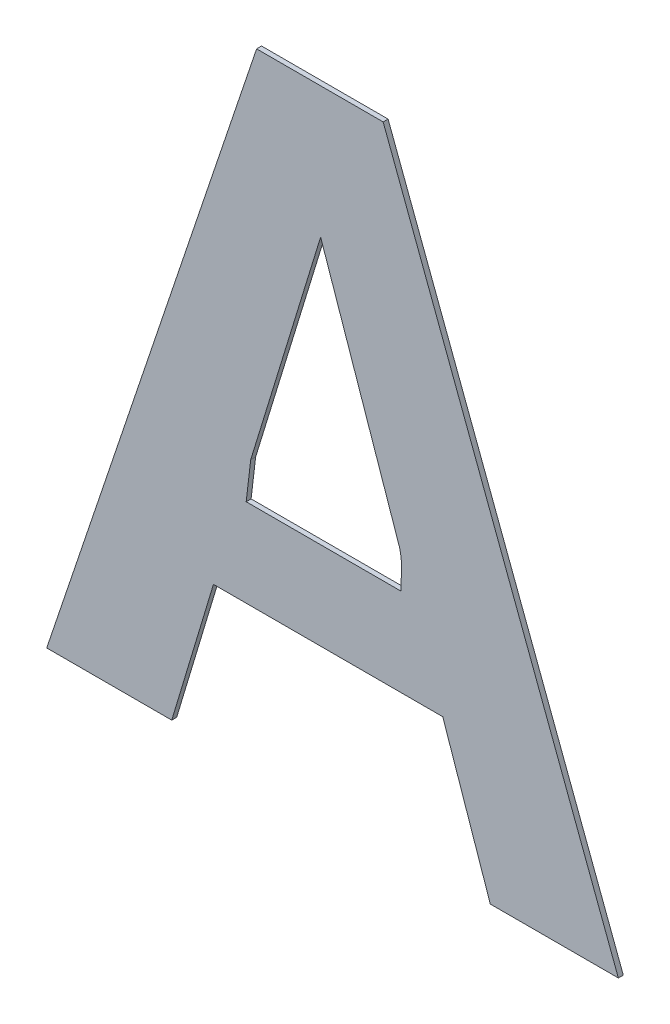
ISO-10303-21;
HEADER;
FILE_DESCRIPTION(('STEP AP214'),'2;1');
FILE_NAME('part.step','',(''),(''),'','','');
FILE_SCHEMA(('AUTOMOTIVE_DESIGN { 1 0 10303 214 1 1 1 1 }'));
ENDSEC;
DATA;
#1=APPLICATION_CONTEXT('core data for automotive mechanical design processes');
#2=APPLICATION_PROTOCOL_DEFINITION('international standard','automotive_design',2000,#1);
#3=PRODUCT_CONTEXT('',#1,'mechanical');
#4=PRODUCT('Part','Part','',(#3));
#5=PRODUCT_RELATED_PRODUCT_CATEGORY('part','',(#4));
#6=PRODUCT_DEFINITION_FORMATION('','',#4);
#7=PRODUCT_DEFINITION_CONTEXT('part definition',#1,'design');
#8=PRODUCT_DEFINITION('design','',#6,#7);
#9=PRODUCT_DEFINITION_SHAPE('','',#8);
#10=(LENGTH_UNIT() NAMED_UNIT(*) SI_UNIT(.MILLI.,.METRE.));
#11=(NAMED_UNIT(*) PLANE_ANGLE_UNIT() SI_UNIT($,.RADIAN.));
#12=(NAMED_UNIT(*) SI_UNIT($,.STERADIAN.) SOLID_ANGLE_UNIT());
#13=UNCERTAINTY_MEASURE_WITH_UNIT(LENGTH_MEASURE(1.E-05),#10,'distance_accuracy_value','');
#14=(GEOMETRIC_REPRESENTATION_CONTEXT(3) GLOBAL_UNCERTAINTY_ASSIGNED_CONTEXT((#13)) GLOBAL_UNIT_ASSIGNED_CONTEXT((#10,
#11,#12)) REPRESENTATION_CONTEXT('',''));
#15=CARTESIAN_POINT('',(0.,0.,0.));
#16=DIRECTION('',(0.,0.,1.));
#17=DIRECTION('',(1.,0.,0.));
#18=AXIS2_PLACEMENT_3D('',#15,#16,#17);
#19=CARTESIAN_POINT('',(-0.7350314078679,0.048062897260646,0.00086146168299));
#20=DIRECTION('',(-0.945790685009935,-0.324776815903535,0.));
#21=DIRECTION('',(0.,0.,1.));
#22=AXIS2_PLACEMENT_3D('',#19,#20,#21);
#23=PLANE('',#22);
#24=DIRECTION('',(0.,0.,1.));
#25=VECTOR('',#24,1.);
#26=CARTESIAN_POINT('',(-0.7292514969013,0.031231074037092,-0.00033853831701));
#27=LINE('',#26,#25);
#28=CARTESIAN_POINT('',(-0.7292514969013,0.031231074037092,-0.00033853831701));
#29=VERTEX_POINT('',#28);
#30=CARTESIAN_POINT('',(-0.7292514969013,0.031231074037092,0.00086146168299));
#31=VERTEX_POINT('',#30);
#32=EDGE_CURVE('E11',#29,#31,#27,.T.);
#33=ORIENTED_EDGE('',*,*,#32,.T.);
#34=DIRECTION('',(-0.324776815903535,0.945790685009935,0.));
#35=VECTOR('',#34,1.);
#36=CARTESIAN_POINT('',(-0.7292514969013,0.031231074037092,0.00086146168299));
#37=LINE('',#36,#35);
#38=CARTESIAN_POINT('',(-0.7408113188345,0.0648947204842,0.00086146168299));
#39=VERTEX_POINT('',#38);
#40=EDGE_CURVE('E24',#31,#39,#37,.T.);
#41=ORIENTED_EDGE('',*,*,#40,.T.);
#42=DIRECTION('',(0.,0.,1.));
#43=VECTOR('',#42,1.);
#44=CARTESIAN_POINT('',(-0.7408113188345,0.0648947204842,-0.00033853831701));
#45=LINE('',#44,#43);
#46=CARTESIAN_POINT('',(-0.7408113188345,0.0648947204842,-0.00033853831701));
#47=VERTEX_POINT('',#46);
#48=EDGE_CURVE('E224',#47,#39,#45,.T.);
#49=ORIENTED_EDGE('',*,*,#48,.F.);
#50=DIRECTION('',(-0.324776815903535,0.945790685009935,0.));
#51=VECTOR('',#50,1.);
#52=CARTESIAN_POINT('',(-0.7292514969013,0.031231074037092,-0.00033853831701));
#53=LINE('',#52,#51);
#54=EDGE_CURVE('E221',#29,#47,#53,.T.);
#55=ORIENTED_EDGE('',*,*,#54,.F.);
#56=EDGE_LOOP('',(#33,#41,#49,#55));
#57=FACE_BOUND('',#56,.T.);
#58=ADVANCED_FACE('F17',(#57),#23,.T.);
#59=CARTESIAN_POINT('',(-0.7686863844487,0.0648947204842,0.00086146168299));
#60=DIRECTION('',(0.,-1.,0.));
#61=DIRECTION('',(0.,0.,-1.));
#62=AXIS2_PLACEMENT_3D('',#59,#60,#61);
#63=PLANE('',#62);
#64=ORIENTED_EDGE('',*,*,#48,.T.);
#65=DIRECTION('',(-1.,0.,0.));
#66=VECTOR('',#65,1.);
#67=CARTESIAN_POINT('',(-0.7408113188345,0.0648947204842,0.00086146168299));
#68=LINE('',#67,#66);
#69=CARTESIAN_POINT('',(-0.7965614500629,0.0648947204842,0.00086146168299));
#70=VERTEX_POINT('',#69);
#71=EDGE_CURVE('E219',#39,#70,#68,.T.);
#72=ORIENTED_EDGE('',*,*,#71,.T.);
#73=DIRECTION('',(0.,0.,1.));
#74=VECTOR('',#73,1.);
#75=CARTESIAN_POINT('',(-0.7965614500629,0.0648947204842,-0.00033853831701));
#76=LINE('',#75,#74);
#77=CARTESIAN_POINT('',(-0.7965614500629,0.0648947204842,-0.00033853831701));
#78=VERTEX_POINT('',#77);
#79=EDGE_CURVE('E216',#78,#70,#76,.T.);
#80=ORIENTED_EDGE('',*,*,#79,.F.);
#81=DIRECTION('',(-1.,0.,0.));
#82=VECTOR('',#81,1.);
#83=CARTESIAN_POINT('',(-0.7408113188345,0.0648947204842,-0.00033853831701));
#84=LINE('',#83,#82);
#85=EDGE_CURVE('E213',#47,#78,#84,.T.);
#86=ORIENTED_EDGE('',*,*,#85,.F.);
#87=EDGE_LOOP('',(#64,#72,#80,#86));
#88=FACE_BOUND('',#87,.T.);
#89=ADVANCED_FACE('F231',(#88),#63,.T.);
#90=CARTESIAN_POINT('',(-0.8016318769583,0.048062897260646,0.00086146168299));
#91=DIRECTION('',(0.957498753383215,-0.288437406155287,0.));
#92=DIRECTION('',(0.,0.,-1.));
#93=AXIS2_PLACEMENT_3D('',#90,#91,#92);
#94=PLANE('',#93);
#95=ORIENTED_EDGE('',*,*,#79,.T.);
#96=DIRECTION('',(-0.288437406155287,-0.957498753383215,0.));
#97=VECTOR('',#96,1.);
#98=CARTESIAN_POINT('',(-0.7965614500629,0.0648947204842,0.00086146168299));
#99=LINE('',#98,#97);
#100=CARTESIAN_POINT('',(-0.8067023038537,0.031231074037092,0.00086146168299));
#101=VERTEX_POINT('',#100);
#102=EDGE_CURVE('E211',#70,#101,#99,.T.);
#103=ORIENTED_EDGE('',*,*,#102,.T.);
#104=DIRECTION('',(0.,0.,1.));
#105=VECTOR('',#104,1.);
#106=CARTESIAN_POINT('',(-0.8067023038537,0.031231074037092,-0.00033853831701));
#107=LINE('',#106,#105);
#108=CARTESIAN_POINT('',(-0.8067023038537,0.031231074037092,-0.00033853831701));
#109=VERTEX_POINT('',#108);
#110=EDGE_CURVE('E208',#109,#101,#107,.T.);
#111=ORIENTED_EDGE('',*,*,#110,.F.);
#112=DIRECTION('',(-0.288437406155287,-0.957498753383215,0.));
#113=VECTOR('',#112,1.);
#114=CARTESIAN_POINT('',(-0.7965614500629,0.0648947204842,-0.00033853831701));
#115=LINE('',#114,#113);
#116=EDGE_CURVE('E205',#78,#109,#115,.T.);
#117=ORIENTED_EDGE('',*,*,#116,.F.);
#118=EDGE_LOOP('',(#95,#103,#111,#117));
#119=FACE_BOUND('',#118,.T.);
#120=ADVANCED_FACE('F238',(#119),#94,.T.);
#121=CARTESIAN_POINT('',(-0.8218998572515,0.031231074037092,0.00086146168299));
#122=DIRECTION('',(0.,-1.,0.));
#123=DIRECTION('',(0.,0.,-1.));
#124=AXIS2_PLACEMENT_3D('',#121,#122,#123);
#125=PLANE('',#124);
#126=ORIENTED_EDGE('',*,*,#110,.T.);
#127=DIRECTION('',(-1.,0.,0.));
#128=VECTOR('',#127,1.);
#129=CARTESIAN_POINT('',(-0.8067023038537,0.031231074037092,0.00086146168299));
#130=LINE('',#129,#128);
#131=CARTESIAN_POINT('',(-0.8370974106493,0.031231074037092,0.00086146168299));
#132=VERTEX_POINT('',#131);
#133=EDGE_CURVE('E203',#101,#132,#130,.T.);
#134=ORIENTED_EDGE('',*,*,#133,.T.);
#135=DIRECTION('',(0.,0.,1.));
#136=VECTOR('',#135,1.);
#137=CARTESIAN_POINT('',(-0.8370974106493,0.031231074037092,-0.00033853831701));
#138=LINE('',#137,#136);
#139=CARTESIAN_POINT('',(-0.8370974106493,0.031231074037092,-0.00033853831701));
#140=VERTEX_POINT('',#139);
#141=EDGE_CURVE('E200',#140,#132,#138,.T.);
#142=ORIENTED_EDGE('',*,*,#141,.F.);
#143=DIRECTION('',(-1.,0.,0.));
#144=VECTOR('',#143,1.);
#145=CARTESIAN_POINT('',(-0.8067023038537,0.031231074037092,-0.00033853831701));
#146=LINE('',#145,#144);
#147=EDGE_CURVE('E197',#109,#140,#146,.T.);
#148=ORIENTED_EDGE('',*,*,#147,.F.);
#149=EDGE_LOOP('',(#126,#134,#142,#148));
#150=FACE_BOUND('',#149,.T.);
#151=ADVANCED_FACE('F242',(#150),#125,.T.);
#152=CARTESIAN_POINT('',(-0.8115830774205,0.107055919785846,0.00086146168299));
#153=DIRECTION('',(-0.947781810602994,0.318919487473109,0.));
#154=DIRECTION('',(0.,0.,1.));
#155=AXIS2_PLACEMENT_3D('',#152,#153,#154);
#156=PLANE('',#155);
#157=ORIENTED_EDGE('',*,*,#141,.T.);
#158=DIRECTION('',(0.318919487473109,0.947781810602994,0.));
#159=VECTOR('',#158,1.);
#160=CARTESIAN_POINT('',(-0.8370974106493,0.031231074037092,0.00086146168299));
#161=LINE('',#160,#159);
#162=CARTESIAN_POINT('',(-0.7860687441917,0.1828807655346,0.00086146168299));
#163=VERTEX_POINT('',#162);
#164=EDGE_CURVE('E195',#132,#163,#161,.T.);
#165=ORIENTED_EDGE('',*,*,#164,.T.);
#166=DIRECTION('',(0.,0.,1.));
#167=VECTOR('',#166,1.);
#168=CARTESIAN_POINT('',(-0.7860687441917,0.1828807655346,-0.00033853831701));
#169=LINE('',#168,#167);
#170=CARTESIAN_POINT('',(-0.7860687441917,0.1828807655346,-0.00033853831701));
#171=VERTEX_POINT('',#170);
#172=EDGE_CURVE('E192',#171,#163,#169,.T.);
#173=ORIENTED_EDGE('',*,*,#172,.F.);
#174=DIRECTION('',(0.318919487473109,0.947781810602994,0.));
#175=VECTOR('',#174,1.);
#176=CARTESIAN_POINT('',(-0.8370974106493,0.031231074037092,-0.00033853831701));
#177=LINE('',#176,#175);
#178=EDGE_CURVE('E189',#140,#171,#177,.T.);
#179=ORIENTED_EDGE('',*,*,#178,.F.);
#180=EDGE_LOOP('',(#157,#165,#173,#179));
#181=FACE_BOUND('',#180,.T.);
#182=ADVANCED_FACE('F247',(#181),#156,.T.);
#183=CARTESIAN_POINT('',(-0.7706876786207,0.1828807655346,0.00086146168299));
#184=DIRECTION('',(0.,1.,0.));
#185=DIRECTION('',(0.,0.,1.));
#186=AXIS2_PLACEMENT_3D('',#183,#184,#185);
#187=PLANE('',#186);
#188=ORIENTED_EDGE('',*,*,#172,.T.);
#189=DIRECTION('',(1.,0.,0.));
#190=VECTOR('',#189,1.);
#191=CARTESIAN_POINT('',(-0.7860687441917,0.1828807655346,0.00086146168299));
#192=LINE('',#191,#190);
#193=CARTESIAN_POINT('',(-0.7553066130497,0.1828807655346,0.00086146168299));
#194=VERTEX_POINT('',#193);
#195=EDGE_CURVE('E187',#163,#194,#192,.T.);
#196=ORIENTED_EDGE('',*,*,#195,.T.);
#197=DIRECTION('',(0.,0.,1.));
#198=VECTOR('',#197,1.);
#199=CARTESIAN_POINT('',(-0.7553066130497,0.1828807655346,-0.00033853831701));
#200=LINE('',#199,#198);
#201=CARTESIAN_POINT('',(-0.7553066130497,0.1828807655346,-0.00033853831701));
#202=VERTEX_POINT('',#201);
#203=EDGE_CURVE('E184',#202,#194,#200,.T.);
#204=ORIENTED_EDGE('',*,*,#203,.F.);
#205=DIRECTION('',(1.,0.,0.));
#206=VECTOR('',#205,1.);
#207=CARTESIAN_POINT('',(-0.7860687441917,0.1828807655346,-0.00033853831701));
#208=LINE('',#207,#206);
#209=EDGE_CURVE('E181',#171,#202,#208,.T.);
#210=ORIENTED_EDGE('',*,*,#209,.F.);
#211=EDGE_LOOP('',(#188,#196,#204,#210));
#212=FACE_BOUND('',#211,.T.);
#213=ADVANCED_FACE('F250',(#212),#187,.T.);
#214=CARTESIAN_POINT('',(-0.7267144772313,0.107055919785846,0.00086146168299));
#215=DIRECTION('',(0.935687346706647,0.352830255523921,0.));
#216=DIRECTION('',(0.,0.,-1.));
#217=AXIS2_PLACEMENT_3D('',#214,#215,#216);
#218=PLANE('',#217);
#219=ORIENTED_EDGE('',*,*,#203,.T.);
#220=DIRECTION('',(0.352830255523921,-0.935687346706647,0.));
#221=VECTOR('',#220,1.);
#222=CARTESIAN_POINT('',(-0.7553066130497,0.1828807655346,0.00086146168299));
#223=LINE('',#222,#221);
#224=CARTESIAN_POINT('',(-0.6981223414129,0.031231074037092,0.00086146168299));
#225=VERTEX_POINT('',#224);
#226=EDGE_CURVE('E179',#194,#225,#223,.T.);
#227=ORIENTED_EDGE('',*,*,#226,.T.);
#228=DIRECTION('',(0.,0.,1.));
#229=VECTOR('',#228,1.);
#230=CARTESIAN_POINT('',(-0.6981223414129,0.031231074037092,-0.00033853831701));
#231=LINE('',#230,#229);
#232=CARTESIAN_POINT('',(-0.6981223414129,0.031231074037092,-0.00033853831701));
#233=VERTEX_POINT('',#232);
#234=EDGE_CURVE('E176',#233,#225,#231,.T.);
#235=ORIENTED_EDGE('',*,*,#234,.F.);
#236=DIRECTION('',(0.352830255523921,-0.935687346706647,0.));
#237=VECTOR('',#236,1.);
#238=CARTESIAN_POINT('',(-0.7553066130497,0.1828807655346,-0.00033853831701));
#239=LINE('',#238,#237);
#240=EDGE_CURVE('E173',#202,#233,#239,.T.);
#241=ORIENTED_EDGE('',*,*,#240,.F.);
#242=EDGE_LOOP('',(#219,#227,#235,#241));
#243=FACE_BOUND('',#242,.T.);
#244=ADVANCED_FACE('F253',(#243),#218,.T.);
#245=CARTESIAN_POINT('',(-0.7136869191571,0.031231074037092,0.00086146168299));
#246=DIRECTION('',(0.,-1.,0.));
#247=DIRECTION('',(0.,0.,-1.));
#248=AXIS2_PLACEMENT_3D('',#245,#246,#247);
#249=PLANE('',#248);
#250=ORIENTED_EDGE('',*,*,#234,.T.);
#251=DIRECTION('',(-1.,0.,0.));
#252=VECTOR('',#251,1.);
#253=CARTESIAN_POINT('',(-0.6981223414129,0.031231074037092,0.00086146168299));
#254=LINE('',#253,#252);
#255=EDGE_CURVE('E171',#225,#31,#254,.T.);
#256=ORIENTED_EDGE('',*,*,#255,.T.);
#257=ORIENTED_EDGE('',*,*,#32,.F.);
#258=DIRECTION('',(-1.,0.,0.));
#259=VECTOR('',#258,1.);
#260=CARTESIAN_POINT('',(-0.6981223414129,0.031231074037092,-0.00033853831701));
#261=LINE('',#260,#259);
#262=EDGE_CURVE('E168',#233,#29,#261,.T.);
#263=ORIENTED_EDGE('',*,*,#262,.F.);
#264=EDGE_LOOP('',(#250,#256,#257,#263));
#265=FACE_BOUND('',#264,.T.);
#266=ADVANCED_FACE('F255',(#265),#249,.T.);
#267=CARTESIAN_POINT('',(-0.7609127654431,0.1231710340496,0.00086146168299));
#268=DIRECTION('',(-0.94555923032834,-0.325450060594369,0.));
#269=DIRECTION('',(0.,0.,1.));
#270=AXIS2_PLACEMENT_3D('',#267,#268,#269);
#271=PLANE('',#270);
#272=DIRECTION('',(0.,0.,1.));
#273=VECTOR('',#272,1.);
#274=CARTESIAN_POINT('',(-0.7513213644385,0.0953042770574,-0.00033853831701));
#275=LINE('',#274,#273);
#276=CARTESIAN_POINT('',(-0.7513213644385,0.0953042770574,-0.00033853831701));
#277=VERTEX_POINT('',#276);
#278=CARTESIAN_POINT('',(-0.7513213644385,0.0953042770574,0.00086146168299));
#279=VERTEX_POINT('',#278);
#280=EDGE_CURVE('E132',#277,#279,#275,.T.);
#281=ORIENTED_EDGE('',*,*,#280,.T.);
#282=DIRECTION('',(-0.325450060594369,0.945559230328339,0.));
#283=VECTOR('',#282,1.);
#284=CARTESIAN_POINT('',(-0.7513213644385,0.0953042770574,0.00086146168299));
#285=LINE('',#284,#283);
#286=CARTESIAN_POINT('',(-0.7705041664477,0.1510377910418,0.00086146168299));
#287=VERTEX_POINT('',#286);
#288=EDGE_CURVE('E165',#279,#287,#285,.T.);
#289=ORIENTED_EDGE('',*,*,#288,.T.);
#290=DIRECTION('',(0.,0.,1.));
#291=VECTOR('',#290,1.);
#292=CARTESIAN_POINT('',(-0.7705041664477,0.1510377910418,-0.00033853831701));
#293=LINE('',#292,#291);
#294=CARTESIAN_POINT('',(-0.7705041664477,0.1510377910418,-0.00033853831701));
#295=VERTEX_POINT('',#294);
#296=EDGE_CURVE('E162',#295,#287,#293,.T.);
#297=ORIENTED_EDGE('',*,*,#296,.F.);
#298=DIRECTION('',(-0.325450060594369,0.945559230328339,0.));
#299=VECTOR('',#298,1.);
#300=CARTESIAN_POINT('',(-0.7513213644385,0.0953042770574,-0.00033853831701));
#301=LINE('',#300,#299);
#302=EDGE_CURVE('E160',#277,#295,#301,.T.);
#303=ORIENTED_EDGE('',*,*,#302,.F.);
#304=EDGE_LOOP('',(#281,#289,#297,#303));
#305=FACE_BOUND('',#304,.T.);
#306=ADVANCED_FACE('F257',(#305),#271,.T.);
#307=CARTESIAN_POINT('',(-0.7790031642797,0.1233458763564,0.00086146168299));
#308=DIRECTION('',(0.955988278716454,-0.293404858440947,0.));
#309=DIRECTION('',(0.,0.,-1.));
#310=AXIS2_PLACEMENT_3D('',#307,#308,#309);
#311=PLANE('',#310);
#312=ORIENTED_EDGE('',*,*,#296,.T.);
#313=DIRECTION('',(-0.293404858440947,-0.955988278716454,0.));
#314=VECTOR('',#313,1.);
#315=CARTESIAN_POINT('',(-0.7705041664477,0.1510377910418,0.00086146168299));
#316=LINE('',#315,#314);
#317=CARTESIAN_POINT('',(-0.7875021621117,0.095653961671,0.00086146168299));
#318=VERTEX_POINT('',#317);
#319=EDGE_CURVE('E158',#287,#318,#316,.T.);
#320=ORIENTED_EDGE('',*,*,#319,.T.);
#321=DIRECTION('',(0.,0.,1.));
#322=VECTOR('',#321,1.);
#323=CARTESIAN_POINT('',(-0.7875021621117,0.095653961671,-0.00033853831701));
#324=LINE('',#323,#322);
#325=CARTESIAN_POINT('',(-0.7875021621117,0.095653961671,-0.00033853831701));
#326=VERTEX_POINT('',#325);
#327=EDGE_CURVE('E155',#326,#318,#324,.T.);
#328=ORIENTED_EDGE('',*,*,#327,.F.);
#329=DIRECTION('',(-0.293404858440947,-0.955988278716454,0.));
#330=VECTOR('',#329,1.);
#331=CARTESIAN_POINT('',(-0.7705041664477,0.1510377910418,-0.00033853831701));
#332=LINE('',#331,#330);
#333=EDGE_CURVE('E153',#295,#326,#332,.T.);
#334=ORIENTED_EDGE('',*,*,#333,.F.);
#335=EDGE_LOOP('',(#312,#320,#328,#334));
#336=FACE_BOUND('',#335,.T.);
#337=ADVANCED_FACE('F264',(#336),#311,.T.);
#338=CARTESIAN_POINT('',(-0.7880526986313,0.0909577840106,0.00086146168299));
#339=DIRECTION('',(0.993198498677176,-0.116433424004469,0.));
#340=DIRECTION('',(0.,0.,-1.));
#341=AXIS2_PLACEMENT_3D('',#338,#339,#340);
#342=PLANE('',#341);
#343=ORIENTED_EDGE('',*,*,#327,.T.);
#344=DIRECTION('',(-0.116433424004469,-0.993198498677176,0.));
#345=VECTOR('',#344,1.);
#346=CARTESIAN_POINT('',(-0.7875021621117,0.095653961671,0.00086146168299));
#347=LINE('',#346,#345);
#348=CARTESIAN_POINT('',(-0.7886032351509,0.0862616063502,0.00086146168299));
#349=VERTEX_POINT('',#348);
#350=EDGE_CURVE('E151',#318,#349,#347,.T.);
#351=ORIENTED_EDGE('',*,*,#350,.T.);
#352=DIRECTION('',(0.,0.,1.));
#353=VECTOR('',#352,1.);
#354=CARTESIAN_POINT('',(-0.7886032351509,0.0862616063502,-0.00033853831701));
#355=LINE('',#354,#353);
#356=CARTESIAN_POINT('',(-0.7886032351509,0.0862616063502,-0.00033853831701));
#357=VERTEX_POINT('',#356);
#358=EDGE_CURVE('E149',#357,#349,#355,.T.);
#359=ORIENTED_EDGE('',*,*,#358,.F.);
#360=DIRECTION('',(-0.116433424004469,-0.993198498677176,0.));
#361=VECTOR('',#360,1.);
#362=CARTESIAN_POINT('',(-0.7875021621117,0.095653961671,-0.00033853831701));
#363=LINE('',#362,#361);
#364=EDGE_CURVE('E128',#326,#357,#363,.T.);
#365=ORIENTED_EDGE('',*,*,#364,.F.);
#366=EDGE_LOOP('',(#343,#351,#359,#365));
#367=FACE_BOUND('',#366,.T.);
#368=ADVANCED_FACE('F314',(#367),#342,.T.);
#369=CARTESIAN_POINT('',(-0.7697787876215,0.0862616063502,0.00086146168299));
#370=DIRECTION('',(0.,1.,0.));
#371=DIRECTION('',(0.,0.,1.));
#372=AXIS2_PLACEMENT_3D('',#369,#370,#371);
#373=PLANE('',#372);
#374=ORIENTED_EDGE('',*,*,#358,.T.);
#375=DIRECTION('',(1.,0.,0.));
#376=VECTOR('',#375,1.);
#377=CARTESIAN_POINT('',(-0.7886032351509,0.0862616063502,0.00086146168299));
#378=LINE('',#377,#376);
#379=CARTESIAN_POINT('',(-0.7509543400921,0.0862616063502,0.00086146168299));
#380=VERTEX_POINT('',#379);
#381=EDGE_CURVE('E114',#349,#380,#378,.T.);
#382=ORIENTED_EDGE('',*,*,#381,.T.);
#383=DIRECTION('',(0.,0.,1.));
#384=VECTOR('',#383,1.);
#385=CARTESIAN_POINT('',(-0.7509543400921,0.0862616063502,-0.00033853831701));
#386=LINE('',#385,#384);
#387=CARTESIAN_POINT('',(-0.7509543400921,0.0862616063502,-0.00033853831701));
#388=VERTEX_POINT('',#387);
#389=EDGE_CURVE('E108',#388,#380,#386,.T.);
#390=ORIENTED_EDGE('',*,*,#389,.F.);
#391=DIRECTION('',(1.,0.,0.));
#392=VECTOR('',#391,1.);
#393=CARTESIAN_POINT('',(-0.7886032351509,0.0862616063502,-0.00033853831701));
#394=LINE('',#393,#392);
#395=EDGE_CURVE('E112',#357,#388,#394,.T.);
#396=ORIENTED_EDGE('',*,*,#395,.F.);
#397=EDGE_LOOP('',(#374,#382,#390,#396));
#398=FACE_BOUND('',#397,.T.);
#399=ADVANCED_FACE('F111',(#398),#373,.T.);
#400=CARTESIAN_POINT('',(-0.7509543400921,0.0862616063502,0.00086146168299));
#401=CARTESIAN_POINT('',(-0.7509543400921,0.0862616063502,-0.00057853831701));
#402=CARTESIAN_POINT('',(-0.7509543400921,0.0913161384906,0.00086146168299));
#403=CARTESIAN_POINT('',(-0.7509543400921,0.0913161384906,-0.00057853831701));
#404=CARTESIAN_POINT('',(-0.7505880382345,0.0924027617522,0.00086146168299));
#405=CARTESIAN_POINT('',(-0.7505880382345,0.0924027617522,-0.00057853831701));
#406=CARTESIAN_POINT('',(-0.7513213644385,0.0953042770574,0.00086146168299));
#407=CARTESIAN_POINT('',(-0.7513213644385,0.0953042770574,-0.00057853831701));
#408=B_SPLINE_SURFACE_WITH_KNOTS('',3,1,((#400,#401),(#402,#403),(#404,#405),(#406,#407)),
.UNSPECIFIED.,.F.,.F.,.F.,(4,4),(2,2),(0.,1.),(0.,0.00036),.UNSPECIFIED.);
#409=CARTESIAN_POINT('',(-0.7509543400921,0.0862616063502,0.00086146168299));
#410=CARTESIAN_POINT('',(-0.7509543400921,0.0913161384906,0.00086146168299));
#411=CARTESIAN_POINT('',(-0.7505880382345,0.0924027617522,0.00086146168299));
#412=CARTESIAN_POINT('',(-0.7513213644385,0.0953042770574,0.00086146168299));
#413=B_SPLINE_CURVE_WITH_KNOTS('',3,(#409,#410,#411,#412),.UNSPECIFIED.,.F.,.F.,(4,4),(0.,1.),.UNSPECIFIED.);
#414=EDGE_CURVE('E129',#380,#279,#413,.T.);
#415=CARTESIAN_POINT('',(-0.7509543400921,0.0862616063502,-0.00033853831701));
#416=CARTESIAN_POINT('',(-0.7509543400921,0.0913161384906,-0.00033853831701));
#417=CARTESIAN_POINT('',(-0.7505880382345,0.0924027617522,-0.00033853831701));
#418=CARTESIAN_POINT('',(-0.7513213644385,0.0953042770574,-0.00033853831701));
#419=B_SPLINE_CURVE_WITH_KNOTS('',3,(#415,#416,#417,#418),.UNSPECIFIED.,.F.,.F.,(4,4),(0.,1.),.UNSPECIFIED.);
#420=EDGE_CURVE('E125',#388,#277,#419,.T.);
#421=ORIENTED_EDGE('',*,*,#389,.T.);
#422=ORIENTED_EDGE('',*,*,#414,.T.);
#423=ORIENTED_EDGE('',*,*,#280,.F.);
#424=ORIENTED_EDGE('',*,*,#420,.F.);
#425=EDGE_LOOP('',(#421,#422,#423,#424));
#426=FACE_BOUND('',#425,.T.);
#427=ADVANCED_FACE('F131',(#426),#408,.T.);
#428=CARTESIAN_POINT('',(-0.7676098760311,0.031231074037092,-0.00033853831701));
#429=DIRECTION('',(0.,0.,1.));
#430=DIRECTION('',(1.,0.,0.));
#431=AXIS2_PLACEMENT_3D('',#428,#429,#430);
#432=PLANE('',#431);
#433=ORIENTED_EDGE('',*,*,#54,.T.);
#434=ORIENTED_EDGE('',*,*,#85,.T.);
#435=ORIENTED_EDGE('',*,*,#116,.T.);
#436=ORIENTED_EDGE('',*,*,#147,.T.);
#437=ORIENTED_EDGE('',*,*,#178,.T.);
#438=ORIENTED_EDGE('',*,*,#209,.T.);
#439=ORIENTED_EDGE('',*,*,#240,.T.);
#440=ORIENTED_EDGE('',*,*,#262,.T.);
#441=EDGE_LOOP('',(#433,#434,#435,#436,#437,#438,#439,#440));
#442=FACE_BOUND('',#441,.T.);
#443=ORIENTED_EDGE('',*,*,#302,.T.);
#444=ORIENTED_EDGE('',*,*,#333,.T.);
#445=ORIENTED_EDGE('',*,*,#364,.T.);
#446=ORIENTED_EDGE('',*,*,#395,.T.);
#447=ORIENTED_EDGE('',*,*,#420,.T.);
#448=EDGE_LOOP('',(#443,#444,#445,#446,#447));
#449=FACE_BOUND('',#448,.T.);
#450=ADVANCED_FACE('F124',(#442,#449),#432,.F.);
#451=CARTESIAN_POINT('',(-0.7676098760311,0.031231074037092,0.00086146168299));
#452=DIRECTION('',(0.,0.,1.));
#453=DIRECTION('',(1.,0.,0.));
#454=AXIS2_PLACEMENT_3D('',#451,#452,#453);
#455=PLANE('',#454);
#456=ORIENTED_EDGE('',*,*,#40,.F.);
#457=ORIENTED_EDGE('',*,*,#255,.F.);
#458=ORIENTED_EDGE('',*,*,#226,.F.);
#459=ORIENTED_EDGE('',*,*,#195,.F.);
#460=ORIENTED_EDGE('',*,*,#164,.F.);
#461=ORIENTED_EDGE('',*,*,#133,.F.);
#462=ORIENTED_EDGE('',*,*,#102,.F.);
#463=ORIENTED_EDGE('',*,*,#71,.F.);
#464=EDGE_LOOP('',(#456,#457,#458,#459,#460,#461,#462,#463));
#465=FACE_BOUND('',#464,.T.);
#466=ORIENTED_EDGE('',*,*,#288,.F.);
#467=ORIENTED_EDGE('',*,*,#414,.F.);
#468=ORIENTED_EDGE('',*,*,#381,.F.);
#469=ORIENTED_EDGE('',*,*,#350,.F.);
#470=ORIENTED_EDGE('',*,*,#319,.F.);
#471=EDGE_LOOP('',(#466,#467,#468,#469,#470));
#472=FACE_BOUND('',#471,.T.);
#473=ADVANCED_FACE('F233',(#465,#472),#455,.T.);
#474=CLOSED_SHELL('',(#58,#89,#120,#151,#182,#213,#244,#266,#306,#337,#368,#399,#427,#450,#473));
#475=MANIFOLD_SOLID_BREP('B1',#474);
#476=ADVANCED_BREP_SHAPE_REPRESENTATION('',(#18,#475),#14);
#477=SHAPE_DEFINITION_REPRESENTATION(#9,#476);
ENDSEC;
END-ISO-10303-21;
